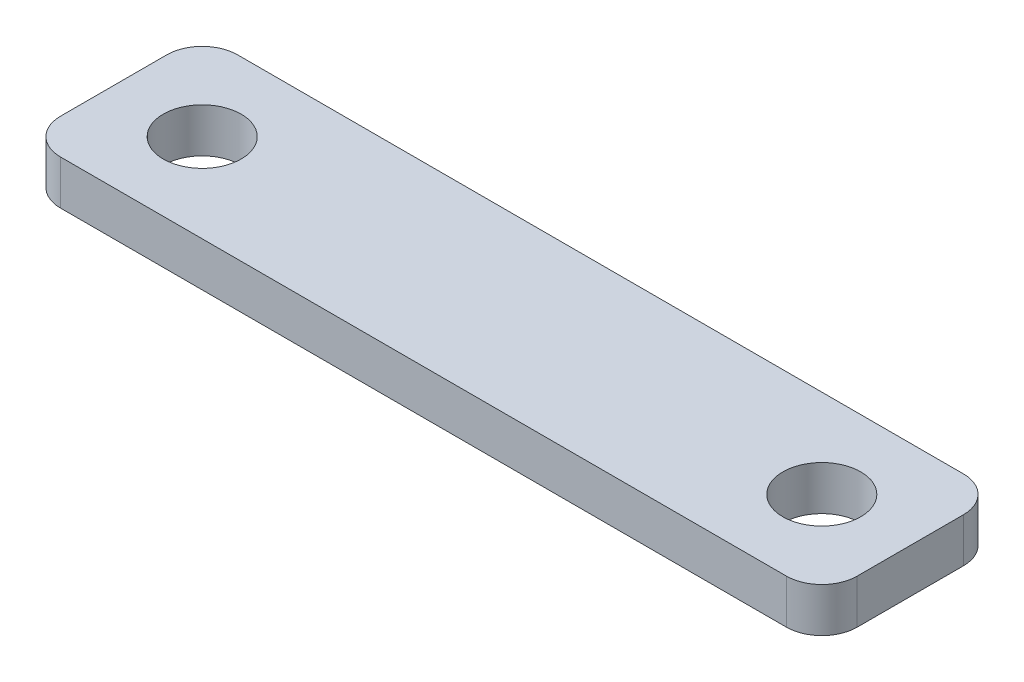
ISO-10303-21;
HEADER;
FILE_DESCRIPTION(('STEP AP214'),'2;1');
FILE_NAME('part.step','',(''),(''),'','','');
FILE_SCHEMA(('AUTOMOTIVE_DESIGN { 1 0 10303 214 1 1 1 1 }'));
ENDSEC;
DATA;
#1=APPLICATION_CONTEXT('core data for automotive mechanical design processes');
#2=APPLICATION_PROTOCOL_DEFINITION('international standard','automotive_design',2000,#1);
#3=PRODUCT_CONTEXT('',#1,'mechanical');
#4=PRODUCT('Part','Part','',(#3));
#5=PRODUCT_RELATED_PRODUCT_CATEGORY('part','',(#4));
#6=PRODUCT_DEFINITION_FORMATION('','',#4);
#7=PRODUCT_DEFINITION_CONTEXT('part definition',#1,'design');
#8=PRODUCT_DEFINITION('design','',#6,#7);
#9=PRODUCT_DEFINITION_SHAPE('','',#8);
#10=(LENGTH_UNIT() NAMED_UNIT(*) SI_UNIT(.MILLI.,.METRE.));
#11=(NAMED_UNIT(*) PLANE_ANGLE_UNIT() SI_UNIT($,.RADIAN.));
#12=(NAMED_UNIT(*) SI_UNIT($,.STERADIAN.) SOLID_ANGLE_UNIT());
#13=UNCERTAINTY_MEASURE_WITH_UNIT(LENGTH_MEASURE(1.E-05),#10,'distance_accuracy_value','');
#14=(GEOMETRIC_REPRESENTATION_CONTEXT(3) GLOBAL_UNCERTAINTY_ASSIGNED_CONTEXT((#13)) GLOBAL_UNIT_ASSIGNED_CONTEXT((#10,
#11,#12)) REPRESENTATION_CONTEXT('',''));
#15=CARTESIAN_POINT('',(0.,0.,0.));
#16=DIRECTION('',(0.,0.,1.));
#17=DIRECTION('',(1.,0.,0.));
#18=AXIS2_PLACEMENT_3D('',#15,#16,#17);
#19=CARTESIAN_POINT('',(26.035,3.175,-3.81));
#20=DIRECTION('',(0.,-1.,0.));
#21=DIRECTION('',(0.,0.,-1.));
#22=AXIS2_PLACEMENT_3D('',#19,#20,#21);
#23=PLANE('',#22);
#24=CARTESIAN_POINT('',(26.035,3.175,-3.81));
#25=DIRECTION('',(0.,1.,0.));
#26=DIRECTION('',(0.,0.,-1.));
#27=AXIS2_PLACEMENT_3D('',#24,#25,#26);
#28=CIRCLE('',#27,2.54);
#29=CARTESIAN_POINT('',(28.575,3.175,-3.80999999999998));
#30=VERTEX_POINT('',#29);
#31=CARTESIAN_POINT('',(26.035,3.175,-6.35));
#32=VERTEX_POINT('',#31);
#33=EDGE_CURVE('E168',#30,#32,#28,.T.);
#34=ORIENTED_EDGE('',*,*,#33,.T.);
#35=DIRECTION('',(-1.,0.,0.));
#36=VECTOR('',#35,1.);
#37=CARTESIAN_POINT('',(-26.035,3.175,-6.35));
#38=LINE('',#37,#36);
#39=CARTESIAN_POINT('',(-26.035,3.175,-6.35));
#40=VERTEX_POINT('',#39);
#41=EDGE_CURVE('E104',#32,#40,#38,.T.);
#42=ORIENTED_EDGE('',*,*,#41,.T.);
#43=CARTESIAN_POINT('',(-26.035,3.175,-3.81));
#44=DIRECTION('',(0.,1.,0.));
#45=DIRECTION('',(0.,0.,-1.));
#46=AXIS2_PLACEMENT_3D('',#43,#44,#45);
#47=CIRCLE('',#46,2.54);
#48=CARTESIAN_POINT('',(-28.575,3.175,-3.80999999999998));
#49=VERTEX_POINT('',#48);
#50=EDGE_CURVE('E189',#40,#49,#47,.T.);
#51=ORIENTED_EDGE('',*,*,#50,.T.);
#52=DIRECTION('',(0.,0.,1.));
#53=VECTOR('',#52,1.);
#54=CARTESIAN_POINT('',(-28.575,3.175,3.80999999999998));
#55=LINE('',#54,#53);
#56=CARTESIAN_POINT('',(-28.575,3.175,3.80999999999998));
#57=VERTEX_POINT('',#56);
#58=EDGE_CURVE('E203',#49,#57,#55,.T.);
#59=ORIENTED_EDGE('',*,*,#58,.T.);
#60=CARTESIAN_POINT('',(-26.035,3.175,3.81));
#61=DIRECTION('',(0.,1.,0.));
#62=DIRECTION('',(0.,0.,-1.));
#63=AXIS2_PLACEMENT_3D('',#60,#61,#62);
#64=CIRCLE('',#63,2.54);
#65=CARTESIAN_POINT('',(-26.035,3.175,6.35));
#66=VERTEX_POINT('',#65);
#67=EDGE_CURVE('E123',#57,#66,#64,.T.);
#68=ORIENTED_EDGE('',*,*,#67,.T.);
#69=DIRECTION('',(1.,0.,0.));
#70=VECTOR('',#69,1.);
#71=CARTESIAN_POINT('',(-26.035,3.175,6.35));
#72=LINE('',#71,#70);
#73=CARTESIAN_POINT('',(26.035,3.175,6.35));
#74=VERTEX_POINT('',#73);
#75=EDGE_CURVE('E117',#66,#74,#72,.T.);
#76=ORIENTED_EDGE('',*,*,#75,.T.);
#77=CARTESIAN_POINT('',(26.035,3.175,3.81));
#78=DIRECTION('',(0.,1.,0.));
#79=DIRECTION('',(0.,0.,1.));
#80=AXIS2_PLACEMENT_3D('',#77,#78,#79);
#81=CIRCLE('',#80,2.54);
#82=CARTESIAN_POINT('',(28.575,3.175,3.80999999999998));
#83=VERTEX_POINT('',#82);
#84=EDGE_CURVE('E121',#74,#83,#81,.T.);
#85=ORIENTED_EDGE('',*,*,#84,.T.);
#86=DIRECTION('',(0.,0.,-1.));
#87=VECTOR('',#86,1.);
#88=CARTESIAN_POINT('',(28.575,3.175,3.80999999999998));
#89=LINE('',#88,#87);
#90=EDGE_CURVE('E61',#83,#30,#89,.T.);
#91=ORIENTED_EDGE('',*,*,#90,.T.);
#92=EDGE_LOOP('',(#34,#42,#51,#59,#68,#76,#85,#91));
#93=FACE_BOUND('',#92,.T.);
#94=CARTESIAN_POINT('',(-22.225,3.175,0.));
#95=DIRECTION('',(0.,1.,0.));
#96=DIRECTION('',(0.,0.,1.));
#97=AXIS2_PLACEMENT_3D('',#94,#95,#96);
#98=CIRCLE('',#97,2.794);
#99=CARTESIAN_POINT('',(-22.225,3.175,2.794));
#100=VERTEX_POINT('',#99);
#101=EDGE_CURVE('E150',#100,#100,#98,.T.);
#102=ORIENTED_EDGE('',*,*,#101,.F.);
#103=EDGE_LOOP('',(#102));
#104=FACE_BOUND('',#103,.T.);
#105=CARTESIAN_POINT('',(22.225,3.175,0.));
#106=DIRECTION('',(0.,1.,0.));
#107=DIRECTION('',(0.,0.,1.));
#108=AXIS2_PLACEMENT_3D('',#105,#106,#107);
#109=CIRCLE('',#108,2.794);
#110=CARTESIAN_POINT('',(22.225,3.175,2.794));
#111=VERTEX_POINT('',#110);
#112=EDGE_CURVE('E217',#111,#111,#109,.T.);
#113=ORIENTED_EDGE('',*,*,#112,.F.);
#114=EDGE_LOOP('',(#113));
#115=FACE_BOUND('',#114,.T.);
#116=ADVANCED_FACE('F43',(#93,#104,#115),#23,.F.);
#117=CARTESIAN_POINT('',(26.035,0.,-3.81));
#118=DIRECTION('',(0.,-1.,0.));
#119=DIRECTION('',(0.,0.,-1.));
#120=AXIS2_PLACEMENT_3D('',#117,#118,#119);
#121=PLANE('',#120);
#122=CARTESIAN_POINT('',(-22.225,0.,0.));
#123=DIRECTION('',(0.,1.,0.));
#124=DIRECTION('',(0.,0.,1.));
#125=AXIS2_PLACEMENT_3D('',#122,#123,#124);
#126=CIRCLE('',#125,2.794);
#127=CARTESIAN_POINT('',(-22.225,0.,2.794));
#128=VERTEX_POINT('',#127);
#129=EDGE_CURVE('E213',#128,#128,#126,.T.);
#130=ORIENTED_EDGE('',*,*,#129,.T.);
#131=EDGE_LOOP('',(#130));
#132=FACE_BOUND('',#131,.T.);
#133=CARTESIAN_POINT('',(26.035,0.,-3.81));
#134=DIRECTION('',(0.,1.,0.));
#135=DIRECTION('',(0.,0.,-1.));
#136=AXIS2_PLACEMENT_3D('',#133,#134,#135);
#137=CIRCLE('',#136,2.54);
#138=CARTESIAN_POINT('',(28.575,0.,-3.80999999999998));
#139=VERTEX_POINT('',#138);
#140=CARTESIAN_POINT('',(26.035,0.,-6.35));
#141=VERTEX_POINT('',#140);
#142=EDGE_CURVE('E145',#139,#141,#137,.T.);
#143=ORIENTED_EDGE('',*,*,#142,.F.);
#144=DIRECTION('',(0.,0.,-1.));
#145=VECTOR('',#144,1.);
#146=CARTESIAN_POINT('',(28.575,0.,3.80999999999998));
#147=LINE('',#146,#145);
#148=CARTESIAN_POINT('',(28.575,0.,3.80999999999998));
#149=VERTEX_POINT('',#148);
#150=EDGE_CURVE('E96',#149,#139,#147,.T.);
#151=ORIENTED_EDGE('',*,*,#150,.F.);
#152=CARTESIAN_POINT('',(26.035,0.,3.81));
#153=DIRECTION('',(0.,1.,0.));
#154=DIRECTION('',(0.,0.,1.));
#155=AXIS2_PLACEMENT_3D('',#152,#153,#154);
#156=CIRCLE('',#155,2.54);
#157=CARTESIAN_POINT('',(26.035,0.,6.35));
#158=VERTEX_POINT('',#157);
#159=EDGE_CURVE('E90',#158,#149,#156,.T.);
#160=ORIENTED_EDGE('',*,*,#159,.F.);
#161=DIRECTION('',(1.,0.,0.));
#162=VECTOR('',#161,1.);
#163=CARTESIAN_POINT('',(-26.035,0.,6.35));
#164=LINE('',#163,#162);
#165=CARTESIAN_POINT('',(-26.035,0.,6.35));
#166=VERTEX_POINT('',#165);
#167=EDGE_CURVE('E132',#166,#158,#164,.T.);
#168=ORIENTED_EDGE('',*,*,#167,.F.);
#169=CARTESIAN_POINT('',(-26.035,0.,3.81));
#170=DIRECTION('',(0.,1.,0.));
#171=DIRECTION('',(0.,0.,-1.));
#172=AXIS2_PLACEMENT_3D('',#169,#170,#171);
#173=CIRCLE('',#172,2.54);
#174=CARTESIAN_POINT('',(-28.575,0.,3.80999999999998));
#175=VERTEX_POINT('',#174);
#176=EDGE_CURVE('E159',#175,#166,#173,.T.);
#177=ORIENTED_EDGE('',*,*,#176,.F.);
#178=DIRECTION('',(0.,0.,1.));
#179=VECTOR('',#178,1.);
#180=CARTESIAN_POINT('',(-28.575,0.,3.80999999999998));
#181=LINE('',#180,#179);
#182=CARTESIAN_POINT('',(-28.575,0.,-3.80999999999998));
#183=VERTEX_POINT('',#182);
#184=EDGE_CURVE('E156',#183,#175,#181,.T.);
#185=ORIENTED_EDGE('',*,*,#184,.F.);
#186=CARTESIAN_POINT('',(-26.035,0.,-3.81));
#187=DIRECTION('',(0.,1.,0.));
#188=DIRECTION('',(0.,0.,-1.));
#189=AXIS2_PLACEMENT_3D('',#186,#187,#188);
#190=CIRCLE('',#189,2.54);
#191=CARTESIAN_POINT('',(-26.035,0.,-6.35));
#192=VERTEX_POINT('',#191);
#193=EDGE_CURVE('E153',#192,#183,#190,.T.);
#194=ORIENTED_EDGE('',*,*,#193,.F.);
#195=DIRECTION('',(-1.,0.,0.));
#196=VECTOR('',#195,1.);
#197=CARTESIAN_POINT('',(-26.035,0.,-6.35));
#198=LINE('',#197,#196);
#199=EDGE_CURVE('E149',#141,#192,#198,.T.);
#200=ORIENTED_EDGE('',*,*,#199,.F.);
#201=EDGE_LOOP('',(#143,#151,#160,#168,#177,#185,#194,#200));
#202=FACE_BOUND('',#201,.T.);
#203=CARTESIAN_POINT('',(22.225,0.,0.));
#204=DIRECTION('',(0.,1.,0.));
#205=DIRECTION('',(0.,0.,1.));
#206=AXIS2_PLACEMENT_3D('',#203,#204,#205);
#207=CIRCLE('',#206,2.794);
#208=CARTESIAN_POINT('',(22.225,0.,2.794));
#209=VERTEX_POINT('',#208);
#210=EDGE_CURVE('E221',#209,#209,#207,.T.);
#211=ORIENTED_EDGE('',*,*,#210,.T.);
#212=EDGE_LOOP('',(#211));
#213=FACE_BOUND('',#212,.T.);
#214=ADVANCED_FACE('F193',(#132,#202,#213),#121,.T.);
#215=CARTESIAN_POINT('',(26.035,3.175,-3.81));
#216=DIRECTION('',(0.,-1.,0.));
#217=DIRECTION('',(0.,0.,-1.));
#218=AXIS2_PLACEMENT_3D('',#215,#216,#217);
#219=CYLINDRICAL_SURFACE('',#218,2.54);
#220=ORIENTED_EDGE('',*,*,#142,.T.);
#221=DIRECTION('',(0.,-1.,0.));
#222=VECTOR('',#221,1.);
#223=CARTESIAN_POINT('',(26.035,3.175,-6.35));
#224=LINE('',#223,#222);
#225=EDGE_CURVE('E11',#32,#141,#224,.T.);
#226=ORIENTED_EDGE('',*,*,#225,.F.);
#227=ORIENTED_EDGE('',*,*,#33,.F.);
#228=DIRECTION('',(0.,-1.,0.));
#229=VECTOR('',#228,1.);
#230=CARTESIAN_POINT('',(28.575,3.175,-3.80999999999998));
#231=LINE('',#230,#229);
#232=EDGE_CURVE('E141',#30,#139,#231,.T.);
#233=ORIENTED_EDGE('',*,*,#232,.T.);
#234=EDGE_LOOP('',(#220,#226,#227,#233));
#235=FACE_BOUND('',#234,.T.);
#236=ADVANCED_FACE('F45',(#235),#219,.T.);
#237=CARTESIAN_POINT('',(-26.035,3.175,-6.35));
#238=DIRECTION('',(0.,0.,1.));
#239=DIRECTION('',(1.,0.,0.));
#240=AXIS2_PLACEMENT_3D('',#237,#238,#239);
#241=PLANE('',#240);
#242=ORIENTED_EDGE('',*,*,#199,.T.);
#243=DIRECTION('',(0.,-1.,0.));
#244=VECTOR('',#243,1.);
#245=CARTESIAN_POINT('',(-26.035,3.175,-6.35));
#246=LINE('',#245,#244);
#247=EDGE_CURVE('E53',#40,#192,#246,.T.);
#248=ORIENTED_EDGE('',*,*,#247,.F.);
#249=ORIENTED_EDGE('',*,*,#41,.F.);
#250=ORIENTED_EDGE('',*,*,#225,.T.);
#251=EDGE_LOOP('',(#242,#248,#249,#250));
#252=FACE_BOUND('',#251,.T.);
#253=ADVANCED_FACE('F255',(#252),#241,.F.);
#254=CARTESIAN_POINT('',(-26.035,3.175,-3.81));
#255=DIRECTION('',(0.,-1.,0.));
#256=DIRECTION('',(0.,0.,-1.));
#257=AXIS2_PLACEMENT_3D('',#254,#255,#256);
#258=CYLINDRICAL_SURFACE('',#257,2.54);
#259=ORIENTED_EDGE('',*,*,#193,.T.);
#260=DIRECTION('',(0.,-1.,0.));
#261=VECTOR('',#260,1.);
#262=CARTESIAN_POINT('',(-28.575,3.175,-3.80999999999998));
#263=LINE('',#262,#261);
#264=EDGE_CURVE('E179',#49,#183,#263,.T.);
#265=ORIENTED_EDGE('',*,*,#264,.F.);
#266=ORIENTED_EDGE('',*,*,#50,.F.);
#267=ORIENTED_EDGE('',*,*,#247,.T.);
#268=EDGE_LOOP('',(#259,#265,#266,#267));
#269=FACE_BOUND('',#268,.T.);
#270=ADVANCED_FACE('F187',(#269),#258,.T.);
#271=CARTESIAN_POINT('',(-28.575,3.175,3.80999999999998));
#272=DIRECTION('',(1.,0.,0.));
#273=DIRECTION('',(0.,0.,-1.));
#274=AXIS2_PLACEMENT_3D('',#271,#272,#273);
#275=PLANE('',#274);
#276=ORIENTED_EDGE('',*,*,#184,.T.);
#277=DIRECTION('',(0.,-1.,0.));
#278=VECTOR('',#277,1.);
#279=CARTESIAN_POINT('',(-28.575,3.175,3.80999999999998));
#280=LINE('',#279,#278);
#281=EDGE_CURVE('E175',#57,#175,#280,.T.);
#282=ORIENTED_EDGE('',*,*,#281,.F.);
#283=ORIENTED_EDGE('',*,*,#58,.F.);
#284=ORIENTED_EDGE('',*,*,#264,.T.);
#285=EDGE_LOOP('',(#276,#282,#283,#284));
#286=FACE_BOUND('',#285,.T.);
#287=ADVANCED_FACE('F198',(#286),#275,.F.);
#288=CARTESIAN_POINT('',(-26.035,3.175,3.81));
#289=DIRECTION('',(0.,-1.,0.));
#290=DIRECTION('',(0.,0.,-1.));
#291=AXIS2_PLACEMENT_3D('',#288,#289,#290);
#292=CYLINDRICAL_SURFACE('',#291,2.54);
#293=ORIENTED_EDGE('',*,*,#176,.T.);
#294=DIRECTION('',(0.,-1.,0.));
#295=VECTOR('',#294,1.);
#296=CARTESIAN_POINT('',(-26.035,3.175,6.35));
#297=LINE('',#296,#295);
#298=EDGE_CURVE('E134',#66,#166,#297,.T.);
#299=ORIENTED_EDGE('',*,*,#298,.F.);
#300=ORIENTED_EDGE('',*,*,#67,.F.);
#301=ORIENTED_EDGE('',*,*,#281,.T.);
#302=EDGE_LOOP('',(#293,#299,#300,#301));
#303=FACE_BOUND('',#302,.T.);
#304=ADVANCED_FACE('F201',(#303),#292,.T.);
#305=CARTESIAN_POINT('',(-26.035,3.175,6.35));
#306=DIRECTION('',(0.,0.,-1.));
#307=DIRECTION('',(-1.,0.,0.));
#308=AXIS2_PLACEMENT_3D('',#305,#306,#307);
#309=PLANE('',#308);
#310=ORIENTED_EDGE('',*,*,#167,.T.);
#311=DIRECTION('',(0.,-1.,0.));
#312=VECTOR('',#311,1.);
#313=CARTESIAN_POINT('',(26.035,3.175,6.35));
#314=LINE('',#313,#312);
#315=EDGE_CURVE('E129',#74,#158,#314,.T.);
#316=ORIENTED_EDGE('',*,*,#315,.F.);
#317=ORIENTED_EDGE('',*,*,#75,.F.);
#318=ORIENTED_EDGE('',*,*,#298,.T.);
#319=EDGE_LOOP('',(#310,#316,#317,#318));
#320=FACE_BOUND('',#319,.T.);
#321=ADVANCED_FACE('F130',(#320),#309,.F.);
#322=CARTESIAN_POINT('',(26.035,3.175,3.81));
#323=DIRECTION('',(0.,-1.,0.));
#324=DIRECTION('',(0.,0.,-1.));
#325=AXIS2_PLACEMENT_3D('',#322,#323,#324);
#326=CYLINDRICAL_SURFACE('',#325,2.54);
#327=ORIENTED_EDGE('',*,*,#159,.T.);
#328=DIRECTION('',(0.,-1.,0.));
#329=VECTOR('',#328,1.);
#330=CARTESIAN_POINT('',(28.575,3.175,3.80999999999998));
#331=LINE('',#330,#329);
#332=EDGE_CURVE('E135',#83,#149,#331,.T.);
#333=ORIENTED_EDGE('',*,*,#332,.F.);
#334=ORIENTED_EDGE('',*,*,#84,.F.);
#335=ORIENTED_EDGE('',*,*,#315,.T.);
#336=EDGE_LOOP('',(#327,#333,#334,#335));
#337=FACE_BOUND('',#336,.T.);
#338=ADVANCED_FACE('F137',(#337),#326,.T.);
#339=CARTESIAN_POINT('',(28.575,3.175,3.80999999999998));
#340=DIRECTION('',(-1.,0.,0.));
#341=DIRECTION('',(0.,0.,1.));
#342=AXIS2_PLACEMENT_3D('',#339,#340,#341);
#343=PLANE('',#342);
#344=ORIENTED_EDGE('',*,*,#150,.T.);
#345=ORIENTED_EDGE('',*,*,#232,.F.);
#346=ORIENTED_EDGE('',*,*,#90,.F.);
#347=ORIENTED_EDGE('',*,*,#332,.T.);
#348=EDGE_LOOP('',(#344,#345,#346,#347));
#349=FACE_BOUND('',#348,.T.);
#350=ADVANCED_FACE('F243',(#349),#343,.F.);
#351=CARTESIAN_POINT('',(-22.225,3.175,0.));
#352=DIRECTION('',(0.,-1.,0.));
#353=DIRECTION('',(0.,0.,-1.));
#354=AXIS2_PLACEMENT_3D('',#351,#352,#353);
#355=CYLINDRICAL_SURFACE('',#354,2.794);
#356=ORIENTED_EDGE('',*,*,#101,.T.);
#357=EDGE_LOOP('',(#356));
#358=FACE_BOUND('',#357,.T.);
#359=ORIENTED_EDGE('',*,*,#129,.F.);
#360=EDGE_LOOP('',(#359));
#361=FACE_BOUND('',#360,.T.);
#362=ADVANCED_FACE('F240',(#358,#361),#355,.F.);
#363=CARTESIAN_POINT('',(22.225,3.175,0.));
#364=DIRECTION('',(0.,-1.,0.));
#365=DIRECTION('',(0.,0.,-1.));
#366=AXIS2_PLACEMENT_3D('',#363,#364,#365);
#367=CYLINDRICAL_SURFACE('',#366,2.794);
#368=ORIENTED_EDGE('',*,*,#112,.T.);
#369=EDGE_LOOP('',(#368));
#370=FACE_BOUND('',#369,.T.);
#371=ORIENTED_EDGE('',*,*,#210,.F.);
#372=EDGE_LOOP('',(#371));
#373=FACE_BOUND('',#372,.T.);
#374=ADVANCED_FACE('F229',(#370,#373),#367,.F.);
#375=CLOSED_SHELL('',(#116,#214,#236,#253,#270,#287,#304,#321,#338,#350,#362,#374));
#376=MANIFOLD_SOLID_BREP('B2',#375);
#377=ADVANCED_BREP_SHAPE_REPRESENTATION('',(#18,#376),#14);
#378=SHAPE_DEFINITION_REPRESENTATION(#9,#377);
ENDSEC;
END-ISO-10303-21;
